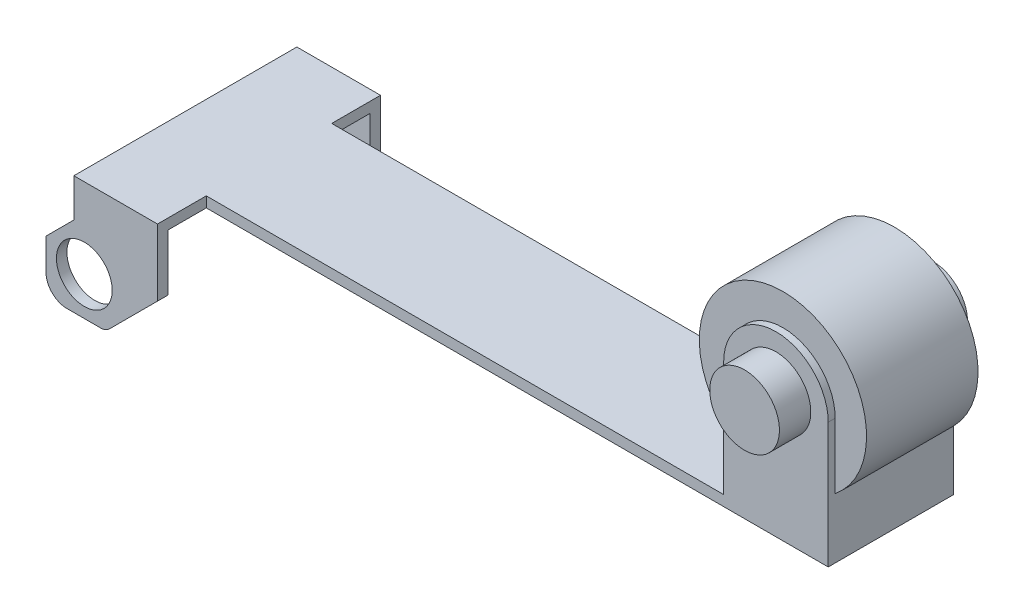
ISO-10303-21;
HEADER;
FILE_DESCRIPTION(('STEP AP214'),'2;1');
FILE_NAME('part.step','',(''),(''),'','','');
FILE_SCHEMA(('AUTOMOTIVE_DESIGN { 1 0 10303 214 1 1 1 1 }'));
ENDSEC;
DATA;
#1=APPLICATION_CONTEXT('core data for automotive mechanical design processes');
#2=APPLICATION_PROTOCOL_DEFINITION('international standard','automotive_design',2000,#1);
#3=PRODUCT_CONTEXT('',#1,'mechanical');
#4=PRODUCT('Part','Part','',(#3));
#5=PRODUCT_RELATED_PRODUCT_CATEGORY('part','',(#4));
#6=PRODUCT_DEFINITION_FORMATION('','',#4);
#7=PRODUCT_DEFINITION_CONTEXT('part definition',#1,'design');
#8=PRODUCT_DEFINITION('design','',#6,#7);
#9=PRODUCT_DEFINITION_SHAPE('','',#8);
#10=(LENGTH_UNIT() NAMED_UNIT(*) SI_UNIT(.MILLI.,.METRE.));
#11=(NAMED_UNIT(*) PLANE_ANGLE_UNIT() SI_UNIT($,.RADIAN.));
#12=(NAMED_UNIT(*) SI_UNIT($,.STERADIAN.) SOLID_ANGLE_UNIT());
#13=UNCERTAINTY_MEASURE_WITH_UNIT(LENGTH_MEASURE(1.E-05),#10,'distance_accuracy_value','');
#14=(GEOMETRIC_REPRESENTATION_CONTEXT(3) GLOBAL_UNCERTAINTY_ASSIGNED_CONTEXT((#13)) GLOBAL_UNIT_ASSIGNED_CONTEXT((#10,
#11,#12)) REPRESENTATION_CONTEXT('',''));
#15=CARTESIAN_POINT('',(0.,0.,0.));
#16=DIRECTION('',(0.,0.,1.));
#17=DIRECTION('',(1.,0.,0.));
#18=AXIS2_PLACEMENT_3D('',#15,#16,#17);
#19=CARTESIAN_POINT('',(-8.7,8.7,0.));
#20=DIRECTION('',(0.,0.,-1.));
#21=DIRECTION('',(1.,0.,0.));
#22=AXIS2_PLACEMENT_3D('',#19,#20,#21);
#23=CYLINDRICAL_SURFACE('',#22,0.8);
#24=CARTESIAN_POINT('',(-8.7,8.7,2.9));
#25=DIRECTION('',(0.,0.,1.));
#26=DIRECTION('',(1.,0.,0.));
#27=AXIS2_PLACEMENT_3D('',#24,#25,#26);
#28=CIRCLE('',#27,0.8);
#29=CARTESIAN_POINT('',(-9.5,8.7,2.9));
#30=VERTEX_POINT('',#29);
#31=EDGE_CURVE('E39',#30,#30,#28,.T.);
#32=ORIENTED_EDGE('',*,*,#31,.F.);
#33=EDGE_LOOP('',(#32));
#34=FACE_BOUND('',#33,.T.);
#35=CARTESIAN_POINT('',(-8.7,8.7,3.2));
#36=DIRECTION('',(0.,0.,-1.));
#37=DIRECTION('',(1.,0.,0.));
#38=AXIS2_PLACEMENT_3D('',#35,#36,#37);
#39=CIRCLE('',#38,0.8);
#40=CARTESIAN_POINT('',(-9.5,8.7,3.2));
#41=VERTEX_POINT('',#40);
#42=EDGE_CURVE('E320',#41,#41,#39,.T.);
#43=ORIENTED_EDGE('',*,*,#42,.F.);
#44=EDGE_LOOP('',(#43));
#45=FACE_BOUND('',#44,.T.);
#46=ADVANCED_FACE('F16',(#34,#45),#23,.F.);
#47=CARTESIAN_POINT('',(-8.7,8.7,0.));
#48=DIRECTION('',(0.,0.,-1.));
#49=DIRECTION('',(1.,0.,0.));
#50=AXIS2_PLACEMENT_3D('',#47,#48,#49);
#51=CYLINDRICAL_SURFACE('',#50,0.8);
#52=CARTESIAN_POINT('',(-8.7,8.7,-3.2));
#53=DIRECTION('',(0.,0.,1.));
#54=DIRECTION('',(1.,0.,0.));
#55=AXIS2_PLACEMENT_3D('',#52,#53,#54);
#56=CIRCLE('',#55,0.8);
#57=CARTESIAN_POINT('',(-9.5,8.7,-3.2));
#58=VERTEX_POINT('',#57);
#59=EDGE_CURVE('E508',#58,#58,#56,.T.);
#60=ORIENTED_EDGE('',*,*,#59,.F.);
#61=EDGE_LOOP('',(#60));
#62=FACE_BOUND('',#61,.T.);
#63=CARTESIAN_POINT('',(-8.7,8.7,-2.9));
#64=DIRECTION('',(0.,0.,-1.));
#65=DIRECTION('',(1.,0.,0.));
#66=AXIS2_PLACEMENT_3D('',#63,#64,#65);
#67=CIRCLE('',#66,0.8);
#68=CARTESIAN_POINT('',(-9.5,8.7,-2.9));
#69=VERTEX_POINT('',#68);
#70=EDGE_CURVE('E436',#69,#69,#67,.T.);
#71=ORIENTED_EDGE('',*,*,#70,.F.);
#72=EDGE_LOOP('',(#71));
#73=FACE_BOUND('',#72,.T.);
#74=ADVANCED_FACE('F652',(#62,#73),#51,.F.);
#75=CARTESIAN_POINT('',(9.75,14.3,0.));
#76=DIRECTION('',(0.,0.,-1.));
#77=DIRECTION('',(1.,0.,0.));
#78=AXIS2_PLACEMENT_3D('',#75,#76,#77);
#79=CYLINDRICAL_SURFACE('',#78,1.);
#80=CARTESIAN_POINT('',(9.75,14.3,2.7));
#81=DIRECTION('',(0.,0.,1.));
#82=DIRECTION('',(1.,0.,0.));
#83=AXIS2_PLACEMENT_3D('',#80,#81,#82);
#84=CIRCLE('',#83,1.);
#85=CARTESIAN_POINT('',(8.75,14.3,2.7));
#86=VERTEX_POINT('',#85);
#87=EDGE_CURVE('E20',#86,#86,#84,.T.);
#88=ORIENTED_EDGE('',*,*,#87,.F.);
#89=EDGE_LOOP('',(#88));
#90=FACE_BOUND('',#89,.T.);
#91=CARTESIAN_POINT('',(9.75,14.3,1.8));
#92=DIRECTION('',(0.,0.,-1.));
#93=DIRECTION('',(1.,0.,0.));
#94=AXIS2_PLACEMENT_3D('',#91,#92,#93);
#95=CIRCLE('',#94,1.);
#96=CARTESIAN_POINT('',(8.75,14.3,1.8));
#97=VERTEX_POINT('',#96);
#98=EDGE_CURVE('E459',#97,#97,#95,.T.);
#99=ORIENTED_EDGE('',*,*,#98,.F.);
#100=EDGE_LOOP('',(#99));
#101=FACE_BOUND('',#100,.T.);
#102=ADVANCED_FACE('F18',(#90,#101),#79,.T.);
#103=CARTESIAN_POINT('',(9.75,14.3,0.));
#104=DIRECTION('',(0.,0.,-1.));
#105=DIRECTION('',(1.,0.,0.));
#106=AXIS2_PLACEMENT_3D('',#103,#104,#105);
#107=CYLINDRICAL_SURFACE('',#106,1.);
#108=CARTESIAN_POINT('',(9.75,14.3,-1.8));
#109=DIRECTION('',(0.,0.,1.));
#110=DIRECTION('',(1.,0.,0.));
#111=AXIS2_PLACEMENT_3D('',#108,#109,#110);
#112=CIRCLE('',#111,1.);
#113=CARTESIAN_POINT('',(8.75,14.3,-1.8));
#114=VERTEX_POINT('',#113);
#115=EDGE_CURVE('E353',#114,#114,#112,.T.);
#116=ORIENTED_EDGE('',*,*,#115,.F.);
#117=EDGE_LOOP('',(#116));
#118=FACE_BOUND('',#117,.T.);
#119=CARTESIAN_POINT('',(9.75,14.3,-2.7));
#120=DIRECTION('',(0.,0.,-1.));
#121=DIRECTION('',(1.,0.,0.));
#122=AXIS2_PLACEMENT_3D('',#119,#120,#121);
#123=CIRCLE('',#122,1.);
#124=CARTESIAN_POINT('',(8.75,14.3,-2.7));
#125=VERTEX_POINT('',#124);
#126=EDGE_CURVE('E426',#125,#125,#123,.T.);
#127=ORIENTED_EDGE('',*,*,#126,.F.);
#128=EDGE_LOOP('',(#127));
#129=FACE_BOUND('',#128,.T.);
#130=ADVANCED_FACE('F664',(#118,#129),#107,.T.);
#131=CARTESIAN_POINT('',(9.75,14.3,0.));
#132=DIRECTION('',(0.,0.,-1.));
#133=DIRECTION('',(1.,0.,0.));
#134=AXIS2_PLACEMENT_3D('',#131,#132,#133);
#135=CYLINDRICAL_SURFACE('',#134,2.4);
#136=CARTESIAN_POINT('',(9.75,14.3,1.6));
#137=DIRECTION('',(0.,0.,1.));
#138=DIRECTION('',(1.,0.,0.));
#139=AXIS2_PLACEMENT_3D('',#136,#137,#138);
#140=CIRCLE('',#139,2.4);
#141=CARTESIAN_POINT('',(11.25,12.4265006004805,1.6));
#142=VERTEX_POINT('',#141);
#143=CARTESIAN_POINT('',(8.25,12.4265006004805,1.6));
#144=VERTEX_POINT('',#143);
#145=EDGE_CURVE('E11',#142,#144,#140,.T.);
#146=ORIENTED_EDGE('',*,*,#145,.F.);
#147=DIRECTION('',(0.,0.,1.));
#148=VECTOR('',#147,1.);
#149=CARTESIAN_POINT('',(11.25,12.4265006004805,0.));
#150=LINE('',#149,#148);
#151=CARTESIAN_POINT('',(11.25,12.4265006004805,-1.6));
#152=VERTEX_POINT('',#151);
#153=EDGE_CURVE('E518',#152,#142,#150,.T.);
#154=ORIENTED_EDGE('',*,*,#153,.F.);
#155=CARTESIAN_POINT('',(9.75,14.3,-1.6));
#156=DIRECTION('',(0.,0.,-1.));
#157=DIRECTION('',(1.,0.,0.));
#158=AXIS2_PLACEMENT_3D('',#155,#156,#157);
#159=CIRCLE('',#158,2.4);
#160=CARTESIAN_POINT('',(8.25,12.4265006004805,-1.6));
#161=VERTEX_POINT('',#160);
#162=EDGE_CURVE('E27',#161,#152,#159,.T.);
#163=ORIENTED_EDGE('',*,*,#162,.F.);
#164=DIRECTION('',(0.,0.,-1.));
#165=VECTOR('',#164,1.);
#166=CARTESIAN_POINT('',(8.25,12.4265006004805,0.));
#167=LINE('',#166,#165);
#168=EDGE_CURVE('E512',#144,#161,#167,.T.);
#169=ORIENTED_EDGE('',*,*,#168,.F.);
#170=EDGE_LOOP('',(#146,#154,#163,#169));
#171=FACE_BOUND('',#170,.T.);
#172=ADVANCED_FACE('F667',(#171),#135,.T.);
#173=CARTESIAN_POINT('',(9.75,14.3,1.6));
#174=DIRECTION('',(0.,0.,1.));
#175=DIRECTION('',(1.,0.,0.));
#176=AXIS2_PLACEMENT_3D('',#173,#174,#175);
#177=PLANE('',#176);
#178=DIRECTION('',(0.,-1.,0.));
#179=VECTOR('',#178,1.);
#180=CARTESIAN_POINT('',(8.25,12.65,1.6));
#181=LINE('',#180,#179);
#182=CARTESIAN_POINT('',(8.25,14.3,1.6));
#183=VERTEX_POINT('',#182);
#184=EDGE_CURVE('E303',#183,#144,#181,.T.);
#185=ORIENTED_EDGE('',*,*,#184,.F.);
#186=CARTESIAN_POINT('',(9.75,14.3,1.6));
#187=DIRECTION('',(0.,0.,1.));
#188=DIRECTION('',(1.,0.,0.));
#189=AXIS2_PLACEMENT_3D('',#186,#187,#188);
#190=CIRCLE('',#189,1.5);
#191=CARTESIAN_POINT('',(11.25,14.3,1.6));
#192=VERTEX_POINT('',#191);
#193=EDGE_CURVE('E409',#192,#183,#190,.T.);
#194=ORIENTED_EDGE('',*,*,#193,.F.);
#195=DIRECTION('',(0.,1.,0.));
#196=VECTOR('',#195,1.);
#197=CARTESIAN_POINT('',(11.25,14.3,1.6));
#198=LINE('',#197,#196);
#199=EDGE_CURVE('E514',#142,#192,#198,.T.);
#200=ORIENTED_EDGE('',*,*,#199,.F.);
#201=ORIENTED_EDGE('',*,*,#145,.T.);
#202=EDGE_LOOP('',(#185,#194,#200,#201));
#203=FACE_BOUND('',#202,.T.);
#204=ADVANCED_FACE('F749',(#203),#177,.T.);
#205=CARTESIAN_POINT('',(9.75,14.3,-1.6));
#206=DIRECTION('',(0.,0.,-1.));
#207=DIRECTION('',(0.,-1.,0.));
#208=AXIS2_PLACEMENT_3D('',#205,#206,#207);
#209=PLANE('',#208);
#210=DIRECTION('',(0.,1.,0.));
#211=VECTOR('',#210,1.);
#212=CARTESIAN_POINT('',(8.25,12.65,-1.6));
#213=LINE('',#212,#211);
#214=CARTESIAN_POINT('',(8.25,14.3,-1.6));
#215=VERTEX_POINT('',#214);
#216=EDGE_CURVE('E379',#161,#215,#213,.T.);
#217=ORIENTED_EDGE('',*,*,#216,.F.);
#218=ORIENTED_EDGE('',*,*,#162,.T.);
#219=DIRECTION('',(0.,-1.,0.));
#220=VECTOR('',#219,1.);
#221=CARTESIAN_POINT('',(11.25,14.3,-1.6));
#222=LINE('',#221,#220);
#223=CARTESIAN_POINT('',(11.25,14.3,-1.6));
#224=VERTEX_POINT('',#223);
#225=EDGE_CURVE('E618',#224,#152,#222,.T.);
#226=ORIENTED_EDGE('',*,*,#225,.F.);
#227=CARTESIAN_POINT('',(9.75,14.3,-1.6));
#228=DIRECTION('',(0.,0.,-1.));
#229=DIRECTION('',(1.,0.,0.));
#230=AXIS2_PLACEMENT_3D('',#227,#228,#229);
#231=CIRCLE('',#230,1.5);
#232=EDGE_CURVE('E526',#215,#224,#231,.T.);
#233=ORIENTED_EDGE('',*,*,#232,.F.);
#234=EDGE_LOOP('',(#217,#218,#226,#233));
#235=FACE_BOUND('',#234,.T.);
#236=ADVANCED_FACE('F747',(#235),#209,.T.);
#237=CARTESIAN_POINT('',(11.25,14.3,-1.8));
#238=DIRECTION('',(1.,0.,0.));
#239=DIRECTION('',(0.,1.,0.));
#240=AXIS2_PLACEMENT_3D('',#237,#238,#239);
#241=PLANE('',#240);
#242=ORIENTED_EDGE('',*,*,#225,.T.);
#243=ORIENTED_EDGE('',*,*,#153,.T.);
#244=ORIENTED_EDGE('',*,*,#199,.T.);
#245=DIRECTION('',(0.,0.,1.));
#246=VECTOR('',#245,1.);
#247=CARTESIAN_POINT('',(11.25,14.3,-1.8));
#248=LINE('',#247,#246);
#249=CARTESIAN_POINT('',(11.25,14.3,1.8));
#250=VERTEX_POINT('',#249);
#251=EDGE_CURVE('E519',#192,#250,#248,.T.);
#252=ORIENTED_EDGE('',*,*,#251,.T.);
#253=DIRECTION('',(0.,-1.,0.));
#254=VECTOR('',#253,1.);
#255=CARTESIAN_POINT('',(11.25,14.3,1.8));
#256=LINE('',#255,#254);
#257=CARTESIAN_POINT('',(11.25,10.7,1.8));
#258=VERTEX_POINT('',#257);
#259=EDGE_CURVE('E408',#250,#258,#256,.T.);
#260=ORIENTED_EDGE('',*,*,#259,.T.);
#261=DIRECTION('',(0.,0.,1.));
#262=VECTOR('',#261,1.);
#263=CARTESIAN_POINT('',(11.25,10.7,-1.8));
#264=LINE('',#263,#262);
#265=CARTESIAN_POINT('',(11.25,10.7,-1.8));
#266=VERTEX_POINT('',#265);
#267=EDGE_CURVE('E410',#266,#258,#264,.T.);
#268=ORIENTED_EDGE('',*,*,#267,.F.);
#269=DIRECTION('',(0.,-1.,0.));
#270=VECTOR('',#269,1.);
#271=CARTESIAN_POINT('',(11.25,14.3,-1.8));
#272=LINE('',#271,#270);
#273=CARTESIAN_POINT('',(11.25,14.3,-1.8));
#274=VERTEX_POINT('',#273);
#275=EDGE_CURVE('E349',#274,#266,#272,.T.);
#276=ORIENTED_EDGE('',*,*,#275,.F.);
#277=DIRECTION('',(0.,0.,1.));
#278=VECTOR('',#277,1.);
#279=CARTESIAN_POINT('',(11.25,14.3,-1.8));
#280=LINE('',#279,#278);
#281=EDGE_CURVE('E404',#274,#224,#280,.T.);
#282=ORIENTED_EDGE('',*,*,#281,.T.);
#283=EDGE_LOOP('',(#242,#243,#244,#252,#260,#268,#276,#282));
#284=FACE_BOUND('',#283,.T.);
#285=ADVANCED_FACE('F685',(#284),#241,.T.);
#286=CARTESIAN_POINT('',(9.75,14.3,-1.8));
#287=DIRECTION('',(0.,0.,-1.));
#288=DIRECTION('',(1.,0.,0.));
#289=AXIS2_PLACEMENT_3D('',#286,#287,#288);
#290=CYLINDRICAL_SURFACE('',#289,1.5);
#291=ORIENTED_EDGE('',*,*,#193,.T.);
#292=DIRECTION('',(0.,0.,1.));
#293=VECTOR('',#292,1.);
#294=CARTESIAN_POINT('',(8.25,14.3,-1.8));
#295=LINE('',#294,#293);
#296=CARTESIAN_POINT('',(8.25,14.3,1.8));
#297=VERTEX_POINT('',#296);
#298=EDGE_CURVE('E566',#183,#297,#295,.T.);
#299=ORIENTED_EDGE('',*,*,#298,.T.);
#300=CARTESIAN_POINT('',(9.75,14.3,1.8));
#301=DIRECTION('',(0.,0.,-1.));
#302=DIRECTION('',(1.,0.,0.));
#303=AXIS2_PLACEMENT_3D('',#300,#301,#302);
#304=CIRCLE('',#303,1.5);
#305=EDGE_CURVE('E297',#297,#250,#304,.T.);
#306=ORIENTED_EDGE('',*,*,#305,.T.);
#307=ORIENTED_EDGE('',*,*,#251,.F.);
#308=EDGE_LOOP('',(#291,#299,#306,#307));
#309=FACE_BOUND('',#308,.T.);
#310=ADVANCED_FACE('F681',(#309),#290,.T.);
#311=CARTESIAN_POINT('',(9.75,14.3,-1.8));
#312=DIRECTION('',(0.,0.,-1.));
#313=DIRECTION('',(1.,0.,0.));
#314=AXIS2_PLACEMENT_3D('',#311,#312,#313);
#315=CYLINDRICAL_SURFACE('',#314,1.5);
#316=ORIENTED_EDGE('',*,*,#232,.T.);
#317=ORIENTED_EDGE('',*,*,#281,.F.);
#318=CARTESIAN_POINT('',(9.75,14.3,-1.8));
#319=DIRECTION('',(0.,0.,1.));
#320=DIRECTION('',(1.,0.,0.));
#321=AXIS2_PLACEMENT_3D('',#318,#319,#320);
#322=CIRCLE('',#321,1.5);
#323=CARTESIAN_POINT('',(8.25,14.3,-1.8));
#324=VERTEX_POINT('',#323);
#325=EDGE_CURVE('E425',#274,#324,#322,.T.);
#326=ORIENTED_EDGE('',*,*,#325,.T.);
#327=DIRECTION('',(0.,0.,1.));
#328=VECTOR('',#327,1.);
#329=CARTESIAN_POINT('',(8.25,14.3,-1.8));
#330=LINE('',#329,#328);
#331=EDGE_CURVE('E421',#324,#215,#330,.T.);
#332=ORIENTED_EDGE('',*,*,#331,.T.);
#333=EDGE_LOOP('',(#316,#317,#326,#332));
#334=FACE_BOUND('',#333,.T.);
#335=ADVANCED_FACE('F684',(#334),#315,.T.);
#336=CARTESIAN_POINT('',(9.75,14.3,-2.7));
#337=DIRECTION('',(0.,0.,-1.));
#338=DIRECTION('',(0.,-1.,0.));
#339=AXIS2_PLACEMENT_3D('',#336,#337,#338);
#340=PLANE('',#339);
#341=ORIENTED_EDGE('',*,*,#126,.T.);
#342=EDGE_LOOP('',(#341));
#343=FACE_BOUND('',#342,.T.);
#344=ADVANCED_FACE('F691',(#343),#340,.T.);
#345=CARTESIAN_POINT('',(9.75,14.3,2.7));
#346=DIRECTION('',(0.,0.,1.));
#347=DIRECTION('',(1.,0.,0.));
#348=AXIS2_PLACEMENT_3D('',#345,#346,#347);
#349=PLANE('',#348);
#350=ORIENTED_EDGE('',*,*,#87,.T.);
#351=EDGE_LOOP('',(#350));
#352=FACE_BOUND('',#351,.T.);
#353=ADVANCED_FACE('F687',(#352),#349,.T.);
#354=CARTESIAN_POINT('',(2.7182298455433,11.5003461494355,-1.8));
#355=DIRECTION('',(0.,0.,1.));
#356=DIRECTION('',(1.,0.,0.));
#357=AXIS2_PLACEMENT_3D('',#354,#355,#356);
#358=PLANE('',#357);
#359=DIRECTION('',(0.,-1.,0.));
#360=VECTOR('',#359,1.);
#361=CARTESIAN_POINT('',(-6.6,11.2501730747178,-1.8));
#362=LINE('',#361,#360);
#363=CARTESIAN_POINT('',(-6.6,11.,-1.8));
#364=VERTEX_POINT('',#363);
#365=CARTESIAN_POINT('',(-6.6,10.7,-1.8));
#366=VERTEX_POINT('',#365);
#367=EDGE_CURVE('E455',#364,#366,#362,.T.);
#368=ORIENTED_EDGE('',*,*,#367,.F.);
#369=DIRECTION('',(1.,0.,0.));
#370=VECTOR('',#369,1.);
#371=CARTESIAN_POINT('',(-8.7,11.,-1.8));
#372=LINE('',#371,#370);
#373=CARTESIAN_POINT('',(8.25,11.,-1.8));
#374=VERTEX_POINT('',#373);
#375=EDGE_CURVE('E352',#364,#374,#372,.T.);
#376=ORIENTED_EDGE('',*,*,#375,.T.);
#377=DIRECTION('',(0.,-1.,0.));
#378=VECTOR('',#377,1.);
#379=CARTESIAN_POINT('',(8.25,14.3,-1.8));
#380=LINE('',#379,#378);
#381=EDGE_CURVE('E308',#324,#374,#380,.T.);
#382=ORIENTED_EDGE('',*,*,#381,.F.);
#383=ORIENTED_EDGE('',*,*,#325,.F.);
#384=ORIENTED_EDGE('',*,*,#275,.T.);
#385=DIRECTION('',(1.,0.,0.));
#386=VECTOR('',#385,1.);
#387=CARTESIAN_POINT('',(-8.7,10.7,-1.8));
#388=LINE('',#387,#386);
#389=EDGE_CURVE('E413',#366,#266,#388,.T.);
#390=ORIENTED_EDGE('',*,*,#389,.F.);
#391=EDGE_LOOP('',(#368,#376,#382,#383,#384,#390));
#392=FACE_BOUND('',#391,.T.);
#393=ORIENTED_EDGE('',*,*,#115,.T.);
#394=EDGE_LOOP('',(#393));
#395=FACE_BOUND('',#394,.T.);
#396=ADVANCED_FACE('F690',(#392,#395),#358,.F.);
#397=CARTESIAN_POINT('',(8.25,11.,-1.8));
#398=DIRECTION('',(-1.,0.,0.));
#399=DIRECTION('',(0.,0.,1.));
#400=AXIS2_PLACEMENT_3D('',#397,#398,#399);
#401=PLANE('',#400);
#402=ORIENTED_EDGE('',*,*,#216,.T.);
#403=ORIENTED_EDGE('',*,*,#331,.F.);
#404=ORIENTED_EDGE('',*,*,#381,.T.);
#405=DIRECTION('',(0.,0.,1.));
#406=VECTOR('',#405,1.);
#407=CARTESIAN_POINT('',(8.25,11.,-1.8));
#408=LINE('',#407,#406);
#409=CARTESIAN_POINT('',(8.25,11.,1.8));
#410=VERTEX_POINT('',#409);
#411=EDGE_CURVE('E302',#374,#410,#408,.T.);
#412=ORIENTED_EDGE('',*,*,#411,.T.);
#413=DIRECTION('',(0.,1.,0.));
#414=VECTOR('',#413,1.);
#415=CARTESIAN_POINT('',(8.25,14.3,1.8));
#416=LINE('',#415,#414);
#417=EDGE_CURVE('E288',#410,#297,#416,.T.);
#418=ORIENTED_EDGE('',*,*,#417,.T.);
#419=ORIENTED_EDGE('',*,*,#298,.F.);
#420=ORIENTED_EDGE('',*,*,#184,.T.);
#421=ORIENTED_EDGE('',*,*,#168,.T.);
#422=EDGE_LOOP('',(#402,#403,#404,#412,#418,#419,#420,#421));
#423=FACE_BOUND('',#422,.T.);
#424=ADVANCED_FACE('F306',(#423),#401,.T.);
#425=CARTESIAN_POINT('',(2.7182298455433,11.5003461494355,1.8));
#426=DIRECTION('',(0.,0.,1.));
#427=DIRECTION('',(1.,0.,0.));
#428=AXIS2_PLACEMENT_3D('',#425,#426,#427);
#429=PLANE('',#428);
#430=DIRECTION('',(0.,1.,0.));
#431=VECTOR('',#430,1.);
#432=CARTESIAN_POINT('',(-6.6,11.2501730747178,1.8));
#433=LINE('',#432,#431);
#434=CARTESIAN_POINT('',(-6.6,10.7,1.8));
#435=VERTEX_POINT('',#434);
#436=CARTESIAN_POINT('',(-6.6,11.,1.8));
#437=VERTEX_POINT('',#436);
#438=EDGE_CURVE('E400',#435,#437,#433,.T.);
#439=ORIENTED_EDGE('',*,*,#438,.F.);
#440=DIRECTION('',(-1.,0.,0.));
#441=VECTOR('',#440,1.);
#442=CARTESIAN_POINT('',(-8.7,10.7,1.8));
#443=LINE('',#442,#441);
#444=EDGE_CURVE('E414',#258,#435,#443,.T.);
#445=ORIENTED_EDGE('',*,*,#444,.F.);
#446=ORIENTED_EDGE('',*,*,#259,.F.);
#447=ORIENTED_EDGE('',*,*,#305,.F.);
#448=ORIENTED_EDGE('',*,*,#417,.F.);
#449=DIRECTION('',(1.,0.,0.));
#450=VECTOR('',#449,1.);
#451=CARTESIAN_POINT('',(-8.7,11.,1.8));
#452=LINE('',#451,#450);
#453=EDGE_CURVE('E294',#437,#410,#452,.T.);
#454=ORIENTED_EDGE('',*,*,#453,.F.);
#455=EDGE_LOOP('',(#439,#445,#446,#447,#448,#454));
#456=FACE_BOUND('',#455,.T.);
#457=ORIENTED_EDGE('',*,*,#98,.T.);
#458=EDGE_LOOP('',(#457));
#459=FACE_BOUND('',#458,.T.);
#460=ADVANCED_FACE('F291',(#456,#459),#429,.T.);
#461=CARTESIAN_POINT('',(-6.6,11.,-3.2));
#462=DIRECTION('',(1.,0.,0.));
#463=DIRECTION('',(0.,0.,1.));
#464=AXIS2_PLACEMENT_3D('',#461,#462,#463);
#465=PLANE('',#464);
#466=ORIENTED_EDGE('',*,*,#367,.T.);
#467=DIRECTION('',(0.,0.,-1.));
#468=VECTOR('',#467,1.);
#469=CARTESIAN_POINT('',(-6.6,10.7,-1.6));
#470=LINE('',#469,#468);
#471=CARTESIAN_POINT('',(-6.6,10.7,-2.9));
#472=VERTEX_POINT('',#471);
#473=EDGE_CURVE('E460',#366,#472,#470,.T.);
#474=ORIENTED_EDGE('',*,*,#473,.T.);
#475=DIRECTION('',(0.,-1.,0.));
#476=VECTOR('',#475,1.);
#477=CARTESIAN_POINT('',(-6.6,9.6,-2.9));
#478=LINE('',#477,#476);
#479=CARTESIAN_POINT('',(-6.6,9.08284271247462,-2.9));
#480=VERTEX_POINT('',#479);
#481=EDGE_CURVE('E468',#472,#480,#478,.T.);
#482=ORIENTED_EDGE('',*,*,#481,.T.);
#483=DIRECTION('',(0.,0.,1.));
#484=VECTOR('',#483,1.);
#485=CARTESIAN_POINT('',(-6.6,9.08284271247462,-3.2));
#486=LINE('',#485,#484);
#487=CARTESIAN_POINT('',(-6.6,9.08284271247462,-3.2));
#488=VERTEX_POINT('',#487);
#489=EDGE_CURVE('E338',#488,#480,#486,.T.);
#490=ORIENTED_EDGE('',*,*,#489,.F.);
#491=DIRECTION('',(0.,-1.,0.));
#492=VECTOR('',#491,1.);
#493=CARTESIAN_POINT('',(-6.6,11.,-3.2));
#494=LINE('',#493,#492);
#495=CARTESIAN_POINT('',(-6.6,11.,-3.2));
#496=VERTEX_POINT('',#495);
#497=EDGE_CURVE('E186',#496,#488,#494,.T.);
#498=ORIENTED_EDGE('',*,*,#497,.F.);
#499=DIRECTION('',(0.,0.,1.));
#500=VECTOR('',#499,1.);
#501=CARTESIAN_POINT('',(-6.6,11.,-3.2));
#502=LINE('',#501,#500);
#503=EDGE_CURVE('E403',#496,#364,#502,.T.);
#504=ORIENTED_EDGE('',*,*,#503,.T.);
#505=EDGE_LOOP('',(#466,#474,#482,#490,#498,#504));
#506=FACE_BOUND('',#505,.T.);
#507=ADVANCED_FACE('F672',(#506),#465,.T.);
#508=CARTESIAN_POINT('',(-6.6,11.,-3.2));
#509=DIRECTION('',(1.,0.,0.));
#510=DIRECTION('',(0.,0.,1.));
#511=AXIS2_PLACEMENT_3D('',#508,#509,#510);
#512=PLANE('',#511);
#513=ORIENTED_EDGE('',*,*,#438,.T.);
#514=DIRECTION('',(0.,0.,1.));
#515=VECTOR('',#514,1.);
#516=CARTESIAN_POINT('',(-6.6,11.,-3.2));
#517=LINE('',#516,#515);
#518=CARTESIAN_POINT('',(-6.6,11.,3.2));
#519=VERTEX_POINT('',#518);
#520=EDGE_CURVE('E317',#437,#519,#517,.T.);
#521=ORIENTED_EDGE('',*,*,#520,.T.);
#522=DIRECTION('',(0.,-1.,0.));
#523=VECTOR('',#522,1.);
#524=CARTESIAN_POINT('',(-6.6,11.,3.2));
#525=LINE('',#524,#523);
#526=CARTESIAN_POINT('',(-6.6,9.08284271247462,3.2));
#527=VERTEX_POINT('',#526);
#528=EDGE_CURVE('E200',#519,#527,#525,.T.);
#529=ORIENTED_EDGE('',*,*,#528,.T.);
#530=DIRECTION('',(0.,0.,1.));
#531=VECTOR('',#530,1.);
#532=CARTESIAN_POINT('',(-6.6,9.08284271247462,-3.2));
#533=LINE('',#532,#531);
#534=CARTESIAN_POINT('',(-6.6,9.08284271247462,2.9));
#535=VERTEX_POINT('',#534);
#536=EDGE_CURVE('E339',#535,#527,#533,.T.);
#537=ORIENTED_EDGE('',*,*,#536,.F.);
#538=DIRECTION('',(0.,1.,0.));
#539=VECTOR('',#538,1.);
#540=CARTESIAN_POINT('',(-6.6,9.6,2.9));
#541=LINE('',#540,#539);
#542=CARTESIAN_POINT('',(-6.6,10.7,2.9));
#543=VERTEX_POINT('',#542);
#544=EDGE_CURVE('E429',#535,#543,#541,.T.);
#545=ORIENTED_EDGE('',*,*,#544,.T.);
#546=DIRECTION('',(0.,0.,-1.));
#547=VECTOR('',#546,1.);
#548=CARTESIAN_POINT('',(-6.6,10.7,-1.6));
#549=LINE('',#548,#547);
#550=EDGE_CURVE('E522',#543,#435,#549,.T.);
#551=ORIENTED_EDGE('',*,*,#550,.T.);
#552=EDGE_LOOP('',(#513,#521,#529,#537,#545,#551));
#553=FACE_BOUND('',#552,.T.);
#554=ADVANCED_FACE('F669',(#553),#512,.T.);
#555=CARTESIAN_POINT('',(-8.7,8.2,2.9));
#556=DIRECTION('',(0.,0.,1.));
#557=DIRECTION('',(1.,0.,0.));
#558=AXIS2_PLACEMENT_3D('',#555,#556,#557);
#559=PLANE('',#558);
#560=DIRECTION('',(0.,-1.,0.));
#561=VECTOR('',#560,1.);
#562=CARTESIAN_POINT('',(-9.,9.05,2.9));
#563=LINE('',#562,#561);
#564=CARTESIAN_POINT('',(-9.,10.7,2.9));
#565=VERTEX_POINT('',#564);
#566=CARTESIAN_POINT('',(-9.,9.9,2.9));
#567=VERTEX_POINT('',#566);
#568=EDGE_CURVE('E343',#565,#567,#563,.T.);
#569=ORIENTED_EDGE('',*,*,#568,.F.);
#570=DIRECTION('',(-1.,0.,0.));
#571=VECTOR('',#570,1.);
#572=CARTESIAN_POINT('',(-8.7,10.7,2.9));
#573=LINE('',#572,#571);
#574=EDGE_CURVE('E440',#543,#565,#573,.T.);
#575=ORIENTED_EDGE('',*,*,#574,.F.);
#576=ORIENTED_EDGE('',*,*,#544,.F.);
#577=DIRECTION('',(0.707106781186548,0.707106781186547,0.));
#578=VECTOR('',#577,1.);
#579=CARTESIAN_POINT('',(-7.34571067811866,8.33713203435597,2.9));
#580=LINE('',#579,#578);
#581=CARTESIAN_POINT('',(-7.97928932188135,7.70355339059327,2.9));
#582=VERTEX_POINT('',#581);
#583=EDGE_CURVE('E335',#582,#535,#580,.T.);
#584=ORIENTED_EDGE('',*,*,#583,.F.);
#585=CARTESIAN_POINT('',(-8.22928932188135,7.95355339059327,2.9));
#586=DIRECTION('',(0.,0.,1.));
#587=DIRECTION('',(1.,0.,0.));
#588=AXIS2_PLACEMENT_3D('',#585,#586,#587);
#589=CIRCLE('',#588,0.353553390593274);
#590=CARTESIAN_POINT('',(-8.22928932188135,7.6,2.9));
#591=VERTEX_POINT('',#590);
#592=EDGE_CURVE('E372',#591,#582,#589,.T.);
#593=ORIENTED_EDGE('',*,*,#592,.F.);
#594=DIRECTION('',(1.,0.,0.));
#595=VECTOR('',#594,1.);
#596=CARTESIAN_POINT('',(-8.46464466094068,7.6,2.9));
#597=LINE('',#596,#595);
#598=CARTESIAN_POINT('',(-9.2,7.6,2.9));
#599=VERTEX_POINT('',#598);
#600=EDGE_CURVE('E376',#599,#591,#597,.T.);
#601=ORIENTED_EDGE('',*,*,#600,.F.);
#602=CARTESIAN_POINT('',(-9.2,8.2,2.9));
#603=DIRECTION('',(0.,0.,1.));
#604=DIRECTION('',(1.,0.,0.));
#605=AXIS2_PLACEMENT_3D('',#602,#603,#604);
#606=CIRCLE('',#605,0.6);
#607=CARTESIAN_POINT('',(-9.8,8.2,2.9));
#608=VERTEX_POINT('',#607);
#609=EDGE_CURVE('E430',#608,#599,#606,.T.);
#610=ORIENTED_EDGE('',*,*,#609,.F.);
#611=DIRECTION('',(0.,-1.,0.));
#612=VECTOR('',#611,1.);
#613=CARTESIAN_POINT('',(-9.8,8.2,2.9));
#614=LINE('',#613,#612);
#615=CARTESIAN_POINT('',(-9.8,9.1,2.9));
#616=VERTEX_POINT('',#615);
#617=EDGE_CURVE('E380',#616,#608,#614,.T.);
#618=ORIENTED_EDGE('',*,*,#617,.F.);
#619=DIRECTION('',(-0.707106781186548,-0.707106781186548,0.));
#620=VECTOR('',#619,1.);
#621=CARTESIAN_POINT('',(-9.75,9.15,2.9));
#622=LINE('',#621,#620);
#623=EDGE_CURVE('E361',#567,#616,#622,.T.);
#624=ORIENTED_EDGE('',*,*,#623,.F.);
#625=EDGE_LOOP('',(#569,#575,#576,#584,#593,#601,#610,#618,#624));
#626=FACE_BOUND('',#625,.T.);
#627=ORIENTED_EDGE('',*,*,#31,.T.);
#628=EDGE_LOOP('',(#627));
#629=FACE_BOUND('',#628,.T.);
#630=ADVANCED_FACE('F671',(#626,#629),#559,.F.);
#631=CARTESIAN_POINT('',(-8.7,8.2,-2.9));
#632=DIRECTION('',(0.,0.,1.));
#633=DIRECTION('',(1.,0.,0.));
#634=AXIS2_PLACEMENT_3D('',#631,#632,#633);
#635=PLANE('',#634);
#636=DIRECTION('',(0.,1.,0.));
#637=VECTOR('',#636,1.);
#638=CARTESIAN_POINT('',(-9.,9.05,-2.9));
#639=LINE('',#638,#637);
#640=CARTESIAN_POINT('',(-9.,9.9,-2.9));
#641=VERTEX_POINT('',#640);
#642=CARTESIAN_POINT('',(-9.,10.7,-2.9));
#643=VERTEX_POINT('',#642);
#644=EDGE_CURVE('E149',#641,#643,#639,.T.);
#645=ORIENTED_EDGE('',*,*,#644,.F.);
#646=DIRECTION('',(0.707106781186548,0.707106781186548,0.));
#647=VECTOR('',#646,1.);
#648=CARTESIAN_POINT('',(-9.75,9.15,-2.9));
#649=LINE('',#648,#647);
#650=CARTESIAN_POINT('',(-9.8,9.1,-2.9));
#651=VERTEX_POINT('',#650);
#652=EDGE_CURVE('E486',#651,#641,#649,.T.);
#653=ORIENTED_EDGE('',*,*,#652,.F.);
#654=DIRECTION('',(0.,1.,0.));
#655=VECTOR('',#654,1.);
#656=CARTESIAN_POINT('',(-9.8,8.2,-2.9));
#657=LINE('',#656,#655);
#658=CARTESIAN_POINT('',(-9.8,8.2,-2.9));
#659=VERTEX_POINT('',#658);
#660=EDGE_CURVE('E165',#659,#651,#657,.T.);
#661=ORIENTED_EDGE('',*,*,#660,.F.);
#662=CARTESIAN_POINT('',(-9.2,8.2,-2.9));
#663=DIRECTION('',(0.,0.,-1.));
#664=DIRECTION('',(1.,0.,0.));
#665=AXIS2_PLACEMENT_3D('',#662,#663,#664);
#666=CIRCLE('',#665,0.6);
#667=CARTESIAN_POINT('',(-9.2,7.6,-2.9));
#668=VERTEX_POINT('',#667);
#669=EDGE_CURVE('E479',#668,#659,#666,.T.);
#670=ORIENTED_EDGE('',*,*,#669,.F.);
#671=DIRECTION('',(-1.,0.,0.));
#672=VECTOR('',#671,1.);
#673=CARTESIAN_POINT('',(-8.46464466094068,7.6,-2.9));
#674=LINE('',#673,#672);
#675=CARTESIAN_POINT('',(-8.22928932188135,7.6,-2.9));
#676=VERTEX_POINT('',#675);
#677=EDGE_CURVE('E394',#676,#668,#674,.T.);
#678=ORIENTED_EDGE('',*,*,#677,.F.);
#679=CARTESIAN_POINT('',(-8.22928932188135,7.95355339059327,-2.9));
#680=DIRECTION('',(0.,0.,-1.));
#681=DIRECTION('',(1.,0.,0.));
#682=AXIS2_PLACEMENT_3D('',#679,#680,#681);
#683=CIRCLE('',#682,0.353553390593274);
#684=CARTESIAN_POINT('',(-7.97928932188135,7.70355339059327,-2.9));
#685=VERTEX_POINT('',#684);
#686=EDGE_CURVE('E360',#685,#676,#683,.T.);
#687=ORIENTED_EDGE('',*,*,#686,.F.);
#688=DIRECTION('',(-0.707106781186548,-0.707106781186547,0.));
#689=VECTOR('',#688,1.);
#690=CARTESIAN_POINT('',(-7.34571067811866,8.33713203435597,-2.9));
#691=LINE('',#690,#689);
#692=EDGE_CURVE('E542',#480,#685,#691,.T.);
#693=ORIENTED_EDGE('',*,*,#692,.F.);
#694=ORIENTED_EDGE('',*,*,#481,.F.);
#695=DIRECTION('',(1.,0.,0.));
#696=VECTOR('',#695,1.);
#697=CARTESIAN_POINT('',(-8.7,10.7,-2.9));
#698=LINE('',#697,#696);
#699=EDGE_CURVE('E541',#643,#472,#698,.T.);
#700=ORIENTED_EDGE('',*,*,#699,.F.);
#701=EDGE_LOOP('',(#645,#653,#661,#670,#678,#687,#693,#694,#700));
#702=FACE_BOUND('',#701,.T.);
#703=ORIENTED_EDGE('',*,*,#70,.T.);
#704=EDGE_LOOP('',(#703));
#705=FACE_BOUND('',#704,.T.);
#706=ADVANCED_FACE('F697',(#702,#705),#635,.T.);
#707=CARTESIAN_POINT('',(-8.7,10.7,0.));
#708=DIRECTION('',(0.,-1.,0.));
#709=DIRECTION('',(0.,0.,-1.));
#710=AXIS2_PLACEMENT_3D('',#707,#708,#709);
#711=PLANE('',#710);
#712=ORIENTED_EDGE('',*,*,#550,.F.);
#713=ORIENTED_EDGE('',*,*,#574,.T.);
#714=DIRECTION('',(0.,0.,1.));
#715=VECTOR('',#714,1.);
#716=CARTESIAN_POINT('',(-9.,10.7,-1.6));
#717=LINE('',#716,#715);
#718=EDGE_CURVE('E451',#643,#565,#717,.T.);
#719=ORIENTED_EDGE('',*,*,#718,.F.);
#720=ORIENTED_EDGE('',*,*,#699,.T.);
#721=ORIENTED_EDGE('',*,*,#473,.F.);
#722=ORIENTED_EDGE('',*,*,#389,.T.);
#723=ORIENTED_EDGE('',*,*,#267,.T.);
#724=ORIENTED_EDGE('',*,*,#444,.T.);
#725=EDGE_LOOP('',(#712,#713,#719,#720,#721,#722,#723,#724));
#726=FACE_BOUND('',#725,.T.);
#727=ADVANCED_FACE('F743',(#726),#711,.T.);
#728=CARTESIAN_POINT('',(-9.8,9.1,-3.2));
#729=DIRECTION('',(-0.707106781186548,0.707106781186548,0.));
#730=DIRECTION('',(0.,0.,1.));
#731=AXIS2_PLACEMENT_3D('',#728,#729,#730);
#732=PLANE('',#731);
#733=ORIENTED_EDGE('',*,*,#652,.T.);
#734=DIRECTION('',(0.,0.,1.));
#735=VECTOR('',#734,1.);
#736=CARTESIAN_POINT('',(-9.,9.9,-3.2));
#737=LINE('',#736,#735);
#738=CARTESIAN_POINT('',(-9.,9.9,-3.2));
#739=VERTEX_POINT('',#738);
#740=EDGE_CURVE('E552',#739,#641,#737,.T.);
#741=ORIENTED_EDGE('',*,*,#740,.F.);
#742=DIRECTION('',(0.707106781186548,0.707106781186548,0.));
#743=VECTOR('',#742,1.);
#744=CARTESIAN_POINT('',(-9.8,9.1,-3.2));
#745=LINE('',#744,#743);
#746=CARTESIAN_POINT('',(-9.8,9.1,-3.2));
#747=VERTEX_POINT('',#746);
#748=EDGE_CURVE('E450',#747,#739,#745,.T.);
#749=ORIENTED_EDGE('',*,*,#748,.F.);
#750=DIRECTION('',(0.,0.,1.));
#751=VECTOR('',#750,1.);
#752=CARTESIAN_POINT('',(-9.8,9.1,-3.2));
#753=LINE('',#752,#751);
#754=EDGE_CURVE('E365',#747,#651,#753,.T.);
#755=ORIENTED_EDGE('',*,*,#754,.T.);
#756=EDGE_LOOP('',(#733,#741,#749,#755));
#757=FACE_BOUND('',#756,.T.);
#758=ADVANCED_FACE('F745',(#757),#732,.T.);
#759=CARTESIAN_POINT('',(-9.8,9.1,-3.2));
#760=DIRECTION('',(-0.707106781186548,0.707106781186548,0.));
#761=DIRECTION('',(0.,0.,1.));
#762=AXIS2_PLACEMENT_3D('',#759,#760,#761);
#763=PLANE('',#762);
#764=ORIENTED_EDGE('',*,*,#623,.T.);
#765=DIRECTION('',(0.,0.,1.));
#766=VECTOR('',#765,1.);
#767=CARTESIAN_POINT('',(-9.8,9.1,-3.2));
#768=LINE('',#767,#766);
#769=CARTESIAN_POINT('',(-9.8,9.1,3.2));
#770=VERTEX_POINT('',#769);
#771=EDGE_CURVE('E366',#616,#770,#768,.T.);
#772=ORIENTED_EDGE('',*,*,#771,.T.);
#773=DIRECTION('',(0.707106781186548,0.707106781186548,0.));
#774=VECTOR('',#773,1.);
#775=CARTESIAN_POINT('',(-9.8,9.1,3.2));
#776=LINE('',#775,#774);
#777=CARTESIAN_POINT('',(-9.,9.9,3.2));
#778=VERTEX_POINT('',#777);
#779=EDGE_CURVE('E576',#770,#778,#776,.T.);
#780=ORIENTED_EDGE('',*,*,#779,.T.);
#781=DIRECTION('',(0.,0.,1.));
#782=VECTOR('',#781,1.);
#783=CARTESIAN_POINT('',(-9.,9.9,-3.2));
#784=LINE('',#783,#782);
#785=EDGE_CURVE('E340',#567,#778,#784,.T.);
#786=ORIENTED_EDGE('',*,*,#785,.F.);
#787=EDGE_LOOP('',(#764,#772,#780,#786));
#788=FACE_BOUND('',#787,.T.);
#789=ADVANCED_FACE('F712',(#788),#763,.T.);
#790=CARTESIAN_POINT('',(-9.8,8.2,-3.2));
#791=DIRECTION('',(-1.,0.,0.));
#792=DIRECTION('',(0.,0.,1.));
#793=AXIS2_PLACEMENT_3D('',#790,#791,#792);
#794=PLANE('',#793);
#795=ORIENTED_EDGE('',*,*,#660,.T.);
#796=ORIENTED_EDGE('',*,*,#754,.F.);
#797=DIRECTION('',(0.,1.,0.));
#798=VECTOR('',#797,1.);
#799=CARTESIAN_POINT('',(-9.8,8.2,-3.2));
#800=LINE('',#799,#798);
#801=CARTESIAN_POINT('',(-9.8,8.2,-3.2));
#802=VERTEX_POINT('',#801);
#803=EDGE_CURVE('E331',#802,#747,#800,.T.);
#804=ORIENTED_EDGE('',*,*,#803,.F.);
#805=DIRECTION('',(0.,0.,1.));
#806=VECTOR('',#805,1.);
#807=CARTESIAN_POINT('',(-9.8,8.2,-3.2));
#808=LINE('',#807,#806);
#809=EDGE_CURVE('E384',#802,#659,#808,.T.);
#810=ORIENTED_EDGE('',*,*,#809,.T.);
#811=EDGE_LOOP('',(#795,#796,#804,#810));
#812=FACE_BOUND('',#811,.T.);
#813=ADVANCED_FACE('F707',(#812),#794,.T.);
#814=CARTESIAN_POINT('',(-9.8,8.2,-3.2));
#815=DIRECTION('',(-1.,0.,0.));
#816=DIRECTION('',(0.,0.,1.));
#817=AXIS2_PLACEMENT_3D('',#814,#815,#816);
#818=PLANE('',#817);
#819=ORIENTED_EDGE('',*,*,#617,.T.);
#820=DIRECTION('',(0.,0.,1.));
#821=VECTOR('',#820,1.);
#822=CARTESIAN_POINT('',(-9.8,8.2,-3.2));
#823=LINE('',#822,#821);
#824=CARTESIAN_POINT('',(-9.8,8.2,3.2));
#825=VERTEX_POINT('',#824);
#826=EDGE_CURVE('E385',#608,#825,#823,.T.);
#827=ORIENTED_EDGE('',*,*,#826,.T.);
#828=DIRECTION('',(0.,1.,0.));
#829=VECTOR('',#828,1.);
#830=CARTESIAN_POINT('',(-9.8,8.2,3.2));
#831=LINE('',#830,#829);
#832=EDGE_CURVE('E472',#825,#770,#831,.T.);
#833=ORIENTED_EDGE('',*,*,#832,.T.);
#834=ORIENTED_EDGE('',*,*,#771,.F.);
#835=EDGE_LOOP('',(#819,#827,#833,#834));
#836=FACE_BOUND('',#835,.T.);
#837=ADVANCED_FACE('F703',(#836),#818,.T.);
#838=CARTESIAN_POINT('',(-9.2,8.2,-3.2));
#839=DIRECTION('',(0.,0.,-1.));
#840=DIRECTION('',(1.,0.,0.));
#841=AXIS2_PLACEMENT_3D('',#838,#839,#840);
#842=CYLINDRICAL_SURFACE('',#841,0.6);
#843=ORIENTED_EDGE('',*,*,#669,.T.);
#844=ORIENTED_EDGE('',*,*,#809,.F.);
#845=CARTESIAN_POINT('',(-9.2,8.2,-3.2));
#846=DIRECTION('',(0.,0.,1.));
#847=DIRECTION('',(1.,0.,0.));
#848=AXIS2_PLACEMENT_3D('',#845,#846,#847);
#849=CIRCLE('',#848,0.6);
#850=CARTESIAN_POINT('',(-9.2,7.6,-3.2));
#851=VERTEX_POINT('',#850);
#852=EDGE_CURVE('E475',#802,#851,#849,.T.);
#853=ORIENTED_EDGE('',*,*,#852,.T.);
#854=DIRECTION('',(0.,0.,1.));
#855=VECTOR('',#854,1.);
#856=CARTESIAN_POINT('',(-9.2,7.6,-3.2));
#857=LINE('',#856,#855);
#858=EDGE_CURVE('E433',#851,#668,#857,.T.);
#859=ORIENTED_EDGE('',*,*,#858,.T.);
#860=EDGE_LOOP('',(#843,#844,#853,#859));
#861=FACE_BOUND('',#860,.T.);
#862=ADVANCED_FACE('F699',(#861),#842,.T.);
#863=CARTESIAN_POINT('',(-9.2,8.2,-3.2));
#864=DIRECTION('',(0.,0.,-1.));
#865=DIRECTION('',(1.,0.,0.));
#866=AXIS2_PLACEMENT_3D('',#863,#864,#865);
#867=CYLINDRICAL_SURFACE('',#866,0.6);
#868=ORIENTED_EDGE('',*,*,#609,.T.);
#869=DIRECTION('',(0.,0.,1.));
#870=VECTOR('',#869,1.);
#871=CARTESIAN_POINT('',(-9.2,7.6,-3.2));
#872=LINE('',#871,#870);
#873=CARTESIAN_POINT('',(-9.2,7.6,3.2));
#874=VERTEX_POINT('',#873);
#875=EDGE_CURVE('E434',#599,#874,#872,.T.);
#876=ORIENTED_EDGE('',*,*,#875,.T.);
#877=CARTESIAN_POINT('',(-9.2,8.2,3.2));
#878=DIRECTION('',(0.,0.,-1.));
#879=DIRECTION('',(1.,0.,0.));
#880=AXIS2_PLACEMENT_3D('',#877,#878,#879);
#881=CIRCLE('',#880,0.6);
#882=EDGE_CURVE('E398',#874,#825,#881,.T.);
#883=ORIENTED_EDGE('',*,*,#882,.T.);
#884=ORIENTED_EDGE('',*,*,#826,.F.);
#885=EDGE_LOOP('',(#868,#876,#883,#884));
#886=FACE_BOUND('',#885,.T.);
#887=ADVANCED_FACE('F702',(#886),#867,.T.);
#888=CARTESIAN_POINT('',(-8.22928932188135,7.6,-3.2));
#889=DIRECTION('',(0.,-1.,0.));
#890=DIRECTION('',(0.,0.,-1.));
#891=AXIS2_PLACEMENT_3D('',#888,#889,#890);
#892=PLANE('',#891);
#893=ORIENTED_EDGE('',*,*,#677,.T.);
#894=ORIENTED_EDGE('',*,*,#858,.F.);
#895=DIRECTION('',(1.,0.,0.));
#896=VECTOR('',#895,1.);
#897=CARTESIAN_POINT('',(-9.2,7.6,-3.2));
#898=LINE('',#897,#896);
#899=CARTESIAN_POINT('',(-8.22928932188135,7.6,-3.2));
#900=VERTEX_POINT('',#899);
#901=EDGE_CURVE('E399',#851,#900,#898,.T.);
#902=ORIENTED_EDGE('',*,*,#901,.T.);
#903=DIRECTION('',(0.,0.,1.));
#904=VECTOR('',#903,1.);
#905=CARTESIAN_POINT('',(-8.22928932188135,7.6,-3.2));
#906=LINE('',#905,#904);
#907=EDGE_CURVE('E420',#900,#676,#906,.T.);
#908=ORIENTED_EDGE('',*,*,#907,.T.);
#909=EDGE_LOOP('',(#893,#894,#902,#908));
#910=FACE_BOUND('',#909,.T.);
#911=ADVANCED_FACE('F679',(#910),#892,.T.);
#912=CARTESIAN_POINT('',(-8.22928932188135,7.6,-3.2));
#913=DIRECTION('',(0.,-1.,0.));
#914=DIRECTION('',(0.,0.,-1.));
#915=AXIS2_PLACEMENT_3D('',#912,#913,#914);
#916=PLANE('',#915);
#917=ORIENTED_EDGE('',*,*,#600,.T.);
#918=DIRECTION('',(0.,0.,1.));
#919=VECTOR('',#918,1.);
#920=CARTESIAN_POINT('',(-8.22928932188135,7.6,-3.2));
#921=LINE('',#920,#919);
#922=CARTESIAN_POINT('',(-8.22928932188135,7.6,3.2));
#923=VERTEX_POINT('',#922);
#924=EDGE_CURVE('E359',#591,#923,#921,.T.);
#925=ORIENTED_EDGE('',*,*,#924,.T.);
#926=DIRECTION('',(-1.,0.,0.));
#927=VECTOR('',#926,1.);
#928=CARTESIAN_POINT('',(-9.2,7.6,3.2));
#929=LINE('',#928,#927);
#930=EDGE_CURVE('E355',#923,#874,#929,.T.);
#931=ORIENTED_EDGE('',*,*,#930,.T.);
#932=ORIENTED_EDGE('',*,*,#875,.F.);
#933=EDGE_LOOP('',(#917,#925,#931,#932));
#934=FACE_BOUND('',#933,.T.);
#935=ADVANCED_FACE('F675',(#934),#916,.T.);
#936=CARTESIAN_POINT('',(-8.22928932188135,7.95355339059327,-3.2));
#937=DIRECTION('',(0.,0.,-1.));
#938=DIRECTION('',(1.,0.,0.));
#939=AXIS2_PLACEMENT_3D('',#936,#937,#938);
#940=CYLINDRICAL_SURFACE('',#939,0.353553390593274);
#941=ORIENTED_EDGE('',*,*,#686,.T.);
#942=ORIENTED_EDGE('',*,*,#907,.F.);
#943=CARTESIAN_POINT('',(-8.22928932188135,7.95355339059327,-3.2));
#944=DIRECTION('',(0.,0.,1.));
#945=DIRECTION('',(1.,0.,0.));
#946=AXIS2_PLACEMENT_3D('',#943,#944,#945);
#947=CIRCLE('',#946,0.353553390593274);
#948=CARTESIAN_POINT('',(-7.97928932188135,7.70355339059327,-3.2));
#949=VERTEX_POINT('',#948);
#950=EDGE_CURVE('E371',#900,#949,#947,.T.);
#951=ORIENTED_EDGE('',*,*,#950,.T.);
#952=DIRECTION('',(0.,0.,1.));
#953=VECTOR('',#952,1.);
#954=CARTESIAN_POINT('',(-7.97928932188135,7.70355339059327,-3.2));
#955=LINE('',#954,#953);
#956=EDGE_CURVE('E367',#949,#685,#955,.T.);
#957=ORIENTED_EDGE('',*,*,#956,.T.);
#958=EDGE_LOOP('',(#941,#942,#951,#957));
#959=FACE_BOUND('',#958,.T.);
#960=ADVANCED_FACE('F678',(#959),#940,.T.);
#961=CARTESIAN_POINT('',(-8.22928932188135,7.95355339059327,-3.2));
#962=DIRECTION('',(0.,0.,-1.));
#963=DIRECTION('',(1.,0.,0.));
#964=AXIS2_PLACEMENT_3D('',#961,#962,#963);
#965=CYLINDRICAL_SURFACE('',#964,0.353553390593274);
#966=ORIENTED_EDGE('',*,*,#592,.T.);
#967=DIRECTION('',(0.,0.,1.));
#968=VECTOR('',#967,1.);
#969=CARTESIAN_POINT('',(-7.97928932188135,7.70355339059327,-3.2));
#970=LINE('',#969,#968);
#971=CARTESIAN_POINT('',(-7.97928932188135,7.70355339059327,3.2));
#972=VERTEX_POINT('',#971);
#973=EDGE_CURVE('E389',#582,#972,#970,.T.);
#974=ORIENTED_EDGE('',*,*,#973,.T.);
#975=CARTESIAN_POINT('',(-8.22928932188135,7.95355339059327,3.2));
#976=DIRECTION('',(0.,0.,-1.));
#977=DIRECTION('',(1.,0.,0.));
#978=AXIS2_PLACEMENT_3D('',#975,#976,#977);
#979=CIRCLE('',#978,0.353553390593274);
#980=EDGE_CURVE('E393',#972,#923,#979,.T.);
#981=ORIENTED_EDGE('',*,*,#980,.T.);
#982=ORIENTED_EDGE('',*,*,#924,.F.);
#983=EDGE_LOOP('',(#966,#974,#981,#982));
#984=FACE_BOUND('',#983,.T.);
#985=ADVANCED_FACE('F742',(#984),#965,.T.);
#986=CARTESIAN_POINT('',(-6.6,9.08284271247462,-3.2));
#987=DIRECTION('',(0.707106781186547,-0.707106781186548,0.));
#988=DIRECTION('',(0.,0.,-1.));
#989=AXIS2_PLACEMENT_3D('',#986,#987,#988);
#990=PLANE('',#989);
#991=ORIENTED_EDGE('',*,*,#692,.T.);
#992=ORIENTED_EDGE('',*,*,#956,.F.);
#993=DIRECTION('',(-0.707106781186548,-0.707106781186547,0.));
#994=VECTOR('',#993,1.);
#995=CARTESIAN_POINT('',(-6.6,9.08284271247462,-3.2));
#996=LINE('',#995,#994);
#997=EDGE_CURVE('E348',#488,#949,#996,.T.);
#998=ORIENTED_EDGE('',*,*,#997,.F.);
#999=ORIENTED_EDGE('',*,*,#489,.T.);
#1000=EDGE_LOOP('',(#991,#992,#998,#999));
#1001=FACE_BOUND('',#1000,.T.);
#1002=ADVANCED_FACE('F1350',(#1001),#990,.T.);
#1003=CARTESIAN_POINT('',(-6.6,9.08284271247462,-3.2));
#1004=DIRECTION('',(0.707106781186547,-0.707106781186548,0.));
#1005=DIRECTION('',(0.,0.,-1.));
#1006=AXIS2_PLACEMENT_3D('',#1003,#1004,#1005);
#1007=PLANE('',#1006);
#1008=ORIENTED_EDGE('',*,*,#583,.T.);
#1009=ORIENTED_EDGE('',*,*,#536,.T.);
#1010=DIRECTION('',(-0.707106781186548,-0.707106781186547,0.));
#1011=VECTOR('',#1010,1.);
#1012=CARTESIAN_POINT('',(-6.6,9.08284271247462,3.2));
#1013=LINE('',#1012,#1011);
#1014=EDGE_CURVE('E388',#527,#972,#1013,.T.);
#1015=ORIENTED_EDGE('',*,*,#1014,.T.);
#1016=ORIENTED_EDGE('',*,*,#973,.F.);
#1017=EDGE_LOOP('',(#1008,#1009,#1015,#1016));
#1018=FACE_BOUND('',#1017,.T.);
#1019=ADVANCED_FACE('F662',(#1018),#1007,.T.);
#1020=CARTESIAN_POINT('',(-9.,9.9,-3.2));
#1021=DIRECTION('',(-1.,0.,0.));
#1022=DIRECTION('',(0.,1.,0.));
#1023=AXIS2_PLACEMENT_3D('',#1020,#1021,#1022);
#1024=PLANE('',#1023);
#1025=ORIENTED_EDGE('',*,*,#568,.T.);
#1026=ORIENTED_EDGE('',*,*,#785,.T.);
#1027=DIRECTION('',(0.,1.,0.));
#1028=VECTOR('',#1027,1.);
#1029=CARTESIAN_POINT('',(-9.,9.9,3.2));
#1030=LINE('',#1029,#1028);
#1031=CARTESIAN_POINT('',(-9.,11.,3.2));
#1032=VERTEX_POINT('',#1031);
#1033=EDGE_CURVE('E344',#778,#1032,#1030,.T.);
#1034=ORIENTED_EDGE('',*,*,#1033,.T.);
#1035=DIRECTION('',(0.,0.,1.));
#1036=VECTOR('',#1035,1.);
#1037=CARTESIAN_POINT('',(-9.,11.,-3.2));
#1038=LINE('',#1037,#1036);
#1039=CARTESIAN_POINT('',(-9.,11.,-3.2));
#1040=VERTEX_POINT('',#1039);
#1041=EDGE_CURVE('E327',#1040,#1032,#1038,.T.);
#1042=ORIENTED_EDGE('',*,*,#1041,.F.);
#1043=DIRECTION('',(0.,1.,0.));
#1044=VECTOR('',#1043,1.);
#1045=CARTESIAN_POINT('',(-9.,9.9,-3.2));
#1046=LINE('',#1045,#1044);
#1047=EDGE_CURVE('E447',#739,#1040,#1046,.T.);
#1048=ORIENTED_EDGE('',*,*,#1047,.F.);
#1049=ORIENTED_EDGE('',*,*,#740,.T.);
#1050=ORIENTED_EDGE('',*,*,#644,.T.);
#1051=ORIENTED_EDGE('',*,*,#718,.T.);
#1052=EDGE_LOOP('',(#1025,#1026,#1034,#1042,#1048,#1049,#1050,#1051));
#1053=FACE_BOUND('',#1052,.T.);
#1054=ADVANCED_FACE('F643',(#1053),#1024,.T.);
#1055=CARTESIAN_POINT('',(-9.,11.,-3.2));
#1056=DIRECTION('',(0.,1.,0.));
#1057=DIRECTION('',(1.,0.,0.));
#1058=AXIS2_PLACEMENT_3D('',#1055,#1056,#1057);
#1059=PLANE('',#1058);
#1060=ORIENTED_EDGE('',*,*,#503,.F.);
#1061=DIRECTION('',(1.,0.,0.));
#1062=VECTOR('',#1061,1.);
#1063=CARTESIAN_POINT('',(-9.,11.,-3.2));
#1064=LINE('',#1063,#1062);
#1065=EDGE_CURVE('E347',#1040,#496,#1064,.T.);
#1066=ORIENTED_EDGE('',*,*,#1065,.F.);
#1067=ORIENTED_EDGE('',*,*,#1041,.T.);
#1068=DIRECTION('',(1.,0.,0.));
#1069=VECTOR('',#1068,1.);
#1070=CARTESIAN_POINT('',(-9.,11.,3.2));
#1071=LINE('',#1070,#1069);
#1072=EDGE_CURVE('E319',#1032,#519,#1071,.T.);
#1073=ORIENTED_EDGE('',*,*,#1072,.T.);
#1074=ORIENTED_EDGE('',*,*,#520,.F.);
#1075=ORIENTED_EDGE('',*,*,#453,.T.);
#1076=ORIENTED_EDGE('',*,*,#411,.F.);
#1077=ORIENTED_EDGE('',*,*,#375,.F.);
#1078=EDGE_LOOP('',(#1060,#1066,#1067,#1073,#1074,#1075,#1076,#1077));
#1079=FACE_BOUND('',#1078,.T.);
#1080=ADVANCED_FACE('F315',(#1079),#1059,.T.);
#1081=CARTESIAN_POINT('',(-8.1689826886602,9.39817341097957,3.2));
#1082=DIRECTION('',(0.,0.,1.));
#1083=DIRECTION('',(1.,0.,0.));
#1084=AXIS2_PLACEMENT_3D('',#1081,#1082,#1083);
#1085=PLANE('',#1084);
#1086=ORIENTED_EDGE('',*,*,#882,.F.);
#1087=ORIENTED_EDGE('',*,*,#930,.F.);
#1088=ORIENTED_EDGE('',*,*,#980,.F.);
#1089=ORIENTED_EDGE('',*,*,#1014,.F.);
#1090=ORIENTED_EDGE('',*,*,#528,.F.);
#1091=ORIENTED_EDGE('',*,*,#1072,.F.);
#1092=ORIENTED_EDGE('',*,*,#1033,.F.);
#1093=ORIENTED_EDGE('',*,*,#779,.F.);
#1094=ORIENTED_EDGE('',*,*,#832,.F.);
#1095=EDGE_LOOP('',(#1086,#1087,#1088,#1089,#1090,#1091,#1092,#1093,#1094));
#1096=FACE_BOUND('',#1095,.T.);
#1097=ORIENTED_EDGE('',*,*,#42,.T.);
#1098=EDGE_LOOP('',(#1097));
#1099=FACE_BOUND('',#1098,.T.);
#1100=ADVANCED_FACE('F644',(#1096,#1099),#1085,.T.);
#1101=CARTESIAN_POINT('',(-8.1689826886602,9.39817341097957,-3.2));
#1102=DIRECTION('',(0.,0.,1.));
#1103=DIRECTION('',(1.,0.,0.));
#1104=AXIS2_PLACEMENT_3D('',#1101,#1102,#1103);
#1105=PLANE('',#1104);
#1106=ORIENTED_EDGE('',*,*,#901,.F.);
#1107=ORIENTED_EDGE('',*,*,#852,.F.);
#1108=ORIENTED_EDGE('',*,*,#803,.T.);
#1109=ORIENTED_EDGE('',*,*,#748,.T.);
#1110=ORIENTED_EDGE('',*,*,#1047,.T.);
#1111=ORIENTED_EDGE('',*,*,#1065,.T.);
#1112=ORIENTED_EDGE('',*,*,#497,.T.);
#1113=ORIENTED_EDGE('',*,*,#997,.T.);
#1114=ORIENTED_EDGE('',*,*,#950,.F.);
#1115=EDGE_LOOP('',(#1106,#1107,#1108,#1109,#1110,#1111,#1112,#1113,#1114));
#1116=FACE_BOUND('',#1115,.T.);
#1117=ORIENTED_EDGE('',*,*,#59,.T.);
#1118=EDGE_LOOP('',(#1117));
#1119=FACE_BOUND('',#1118,.T.);
#1120=ADVANCED_FACE('F648',(#1116,#1119),#1105,.F.);
#1121=CLOSED_SHELL('',(#46,#74,#102,#130,#172,#204,#236,#285,#310,#335,#344,#353,#396,#424,#460,
#507,#554,#630,#706,#727,#758,#789,#813,#837,#862,#887,#911,#935,#960,#985,#1002,#1019,#1054,
#1080,#1100,#1120));
#1122=MANIFOLD_SOLID_BREP('B1',#1121);
#1123=ADVANCED_BREP_SHAPE_REPRESENTATION('',(#18,#1122),#14);
#1124=SHAPE_DEFINITION_REPRESENTATION(#9,#1123);
ENDSEC;
END-ISO-10303-21;
